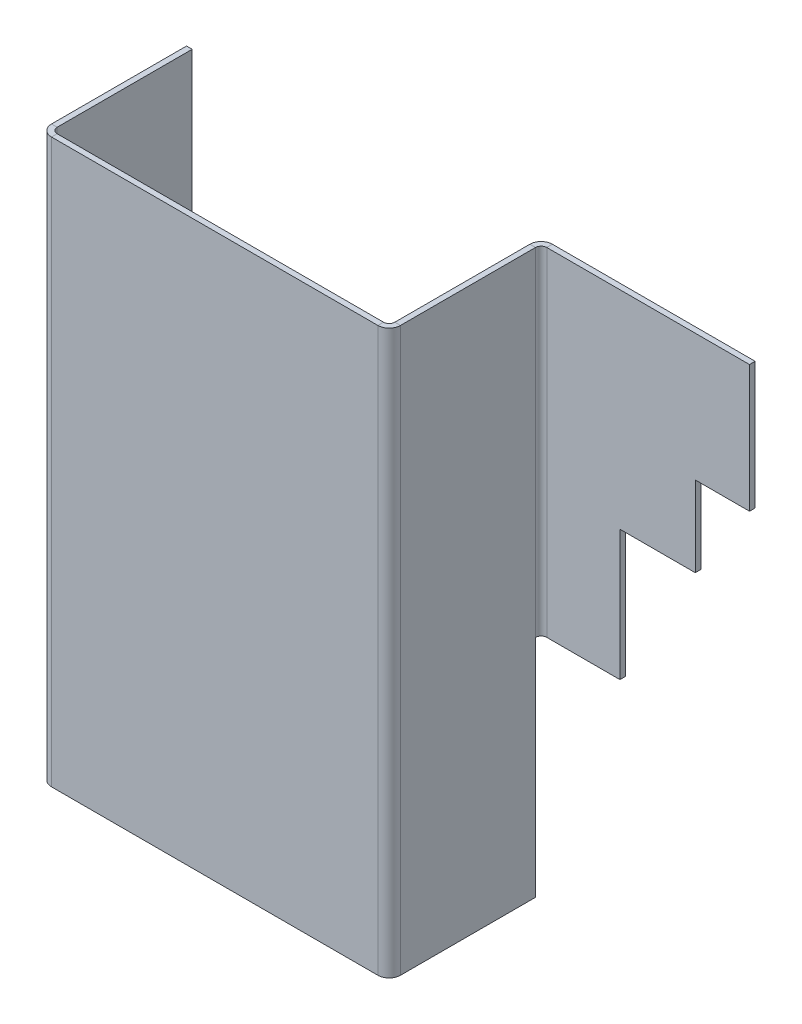
ISO-10303-21;
HEADER;
FILE_DESCRIPTION(('STEP AP214'),'2;1');
FILE_NAME('part.step','',(''),(''),'','','');
FILE_SCHEMA(('AUTOMOTIVE_DESIGN { 1 0 10303 214 1 1 1 1 }'));
ENDSEC;
DATA;
#1=APPLICATION_CONTEXT('core data for automotive mechanical design processes');
#2=APPLICATION_PROTOCOL_DEFINITION('international standard','automotive_design',2000,#1);
#3=PRODUCT_CONTEXT('',#1,'mechanical');
#4=PRODUCT('Part','Part','',(#3));
#5=PRODUCT_RELATED_PRODUCT_CATEGORY('part','',(#4));
#6=PRODUCT_DEFINITION_FORMATION('','',#4);
#7=PRODUCT_DEFINITION_CONTEXT('part definition',#1,'design');
#8=PRODUCT_DEFINITION('design','',#6,#7);
#9=PRODUCT_DEFINITION_SHAPE('','',#8);
#10=(LENGTH_UNIT() NAMED_UNIT(*) SI_UNIT(.MILLI.,.METRE.));
#11=(NAMED_UNIT(*) PLANE_ANGLE_UNIT() SI_UNIT($,.RADIAN.));
#12=(NAMED_UNIT(*) SI_UNIT($,.STERADIAN.) SOLID_ANGLE_UNIT());
#13=UNCERTAINTY_MEASURE_WITH_UNIT(LENGTH_MEASURE(1.E-05),#10,'distance_accuracy_value','');
#14=(GEOMETRIC_REPRESENTATION_CONTEXT(3) GLOBAL_UNCERTAINTY_ASSIGNED_CONTEXT((#13)) GLOBAL_UNIT_ASSIGNED_CONTEXT((#10,
#11,#12)) REPRESENTATION_CONTEXT('',''));
#15=CARTESIAN_POINT('',(0.,0.,0.));
#16=DIRECTION('',(0.,0.,1.));
#17=DIRECTION('',(1.,0.,0.));
#18=AXIS2_PLACEMENT_3D('',#15,#16,#17);
#19=CARTESIAN_POINT('',(60.,100.,-1.));
#20=DIRECTION('',(0.,1.,0.));
#21=DIRECTION('',(0.,0.,1.));
#22=AXIS2_PLACEMENT_3D('',#19,#20,#21);
#23=PLANE('',#22);
#24=DIRECTION('',(1.,0.,0.));
#25=VECTOR('',#24,1.);
#26=CARTESIAN_POINT('',(60.,100.,-1.));
#27=LINE('',#26,#25);
#28=CARTESIAN_POINT('',(60.,100.,-1.));
#29=VERTEX_POINT('',#28);
#30=CARTESIAN_POINT('',(61.,100.,-1.));
#31=VERTEX_POINT('',#30);
#32=EDGE_CURVE('E13',#29,#31,#27,.T.);
#33=ORIENTED_EDGE('',*,*,#32,.F.);
#34=CARTESIAN_POINT('',(59.,100.,-1.));
#35=DIRECTION('',(0.,1.,0.));
#36=DIRECTION('',(0.,0.,1.));
#37=AXIS2_PLACEMENT_3D('',#34,#35,#36);
#38=CIRCLE('',#37,1.);
#39=CARTESIAN_POINT('',(59.,100.,0.));
#40=VERTEX_POINT('',#39);
#41=EDGE_CURVE('E299',#40,#29,#38,.T.);
#42=ORIENTED_EDGE('',*,*,#41,.F.);
#43=DIRECTION('',(0.,0.,-1.));
#44=VECTOR('',#43,1.);
#45=CARTESIAN_POINT('',(59.,100.,1.));
#46=LINE('',#45,#44);
#47=CARTESIAN_POINT('',(59.,100.,1.));
#48=VERTEX_POINT('',#47);
#49=EDGE_CURVE('E66',#48,#40,#46,.T.);
#50=ORIENTED_EDGE('',*,*,#49,.F.);
#51=CARTESIAN_POINT('',(59.,100.,-1.));
#52=DIRECTION('',(0.,1.,0.));
#53=DIRECTION('',(1.,0.,0.));
#54=AXIS2_PLACEMENT_3D('',#51,#52,#53);
#55=CIRCLE('',#54,2.);
#56=EDGE_CURVE('E323',#48,#31,#55,.T.);
#57=ORIENTED_EDGE('',*,*,#56,.T.);
#58=EDGE_LOOP('',(#33,#42,#50,#57));
#59=FACE_BOUND('',#58,.T.);
#60=ADVANCED_FACE('F59',(#59),#23,.T.);
#61=CARTESIAN_POINT('',(59.,100.,1.));
#62=DIRECTION('',(0.,1.,0.));
#63=DIRECTION('',(0.,0.,1.));
#64=AXIS2_PLACEMENT_3D('',#61,#62,#63);
#65=PLANE('',#64);
#66=DIRECTION('',(0.,0.,-1.));
#67=VECTOR('',#66,1.);
#68=CARTESIAN_POINT('',(60.,100.,0.));
#69=LINE('',#68,#67);
#70=CARTESIAN_POINT('',(60.,100.,-25.));
#71=VERTEX_POINT('',#70);
#72=EDGE_CURVE('E296',#29,#71,#69,.T.);
#73=ORIENTED_EDGE('',*,*,#72,.F.);
#74=ORIENTED_EDGE('',*,*,#32,.T.);
#75=DIRECTION('',(0.,0.,-1.));
#76=VECTOR('',#75,1.);
#77=CARTESIAN_POINT('',(61.,100.,0.));
#78=LINE('',#77,#76);
#79=CARTESIAN_POINT('',(61.,100.,-25.));
#80=VERTEX_POINT('',#79);
#81=EDGE_CURVE('E290',#31,#80,#78,.T.);
#82=ORIENTED_EDGE('',*,*,#81,.T.);
#83=DIRECTION('',(1.,0.,0.));
#84=VECTOR('',#83,1.);
#85=CARTESIAN_POINT('',(60.,100.,-25.));
#86=LINE('',#85,#84);
#87=EDGE_CURVE('E292',#71,#80,#86,.T.);
#88=ORIENTED_EDGE('',*,*,#87,.F.);
#89=EDGE_LOOP('',(#73,#74,#82,#88));
#90=FACE_BOUND('',#89,.T.);
#91=ADVANCED_FACE('F464',(#90),#65,.T.);
#92=CARTESIAN_POINT('',(59.,0.,0.));
#93=DIRECTION('',(0.,-1.,0.));
#94=DIRECTION('',(0.,0.,-1.));
#95=AXIS2_PLACEMENT_3D('',#92,#93,#94);
#96=PLANE('',#95);
#97=DIRECTION('',(0.,0.,1.));
#98=VECTOR('',#97,1.);
#99=CARTESIAN_POINT('',(59.,0.,0.));
#100=LINE('',#99,#98);
#101=CARTESIAN_POINT('',(59.,0.,0.));
#102=VERTEX_POINT('',#101);
#103=CARTESIAN_POINT('',(59.,0.,1.));
#104=VERTEX_POINT('',#103);
#105=EDGE_CURVE('E405',#102,#104,#100,.T.);
#106=ORIENTED_EDGE('',*,*,#105,.F.);
#107=CARTESIAN_POINT('',(59.,0.,-1.));
#108=DIRECTION('',(0.,1.,0.));
#109=DIRECTION('',(0.,0.,1.));
#110=AXIS2_PLACEMENT_3D('',#107,#108,#109);
#111=CIRCLE('',#110,1.);
#112=CARTESIAN_POINT('',(60.,0.,-1.));
#113=VERTEX_POINT('',#112);
#114=EDGE_CURVE('E335',#102,#113,#111,.T.);
#115=ORIENTED_EDGE('',*,*,#114,.T.);
#116=DIRECTION('',(-1.,0.,0.));
#117=VECTOR('',#116,1.);
#118=CARTESIAN_POINT('',(61.,0.,-1.));
#119=LINE('',#118,#117);
#120=CARTESIAN_POINT('',(61.,0.,-1.));
#121=VERTEX_POINT('',#120);
#122=EDGE_CURVE('E403',#121,#113,#119,.T.);
#123=ORIENTED_EDGE('',*,*,#122,.F.);
#124=CARTESIAN_POINT('',(59.,0.,-1.));
#125=DIRECTION('',(0.,1.,0.));
#126=DIRECTION('',(1.,0.,0.));
#127=AXIS2_PLACEMENT_3D('',#124,#125,#126);
#128=CIRCLE('',#127,2.);
#129=EDGE_CURVE('E293',#104,#121,#128,.T.);
#130=ORIENTED_EDGE('',*,*,#129,.F.);
#131=EDGE_LOOP('',(#106,#115,#123,#130));
#132=FACE_BOUND('',#131,.T.);
#133=ADVANCED_FACE('F512',(#132),#96,.T.);
#134=CARTESIAN_POINT('',(61.,0.,-1.));
#135=DIRECTION('',(0.,-1.,0.));
#136=DIRECTION('',(0.,0.,-1.));
#137=AXIS2_PLACEMENT_3D('',#134,#135,#136);
#138=PLANE('',#137);
#139=DIRECTION('',(1.,0.,0.));
#140=VECTOR('',#139,1.);
#141=CARTESIAN_POINT('',(0.,0.,0.));
#142=LINE('',#141,#140);
#143=CARTESIAN_POINT('',(0.999999999999999,0.,0.));
#144=VERTEX_POINT('',#143);
#145=EDGE_CURVE('E338',#144,#102,#142,.T.);
#146=ORIENTED_EDGE('',*,*,#145,.T.);
#147=ORIENTED_EDGE('',*,*,#105,.T.);
#148=DIRECTION('',(1.,0.,0.));
#149=VECTOR('',#148,1.);
#150=CARTESIAN_POINT('',(0.,0.,1.));
#151=LINE('',#150,#149);
#152=CARTESIAN_POINT('',(0.999999999999999,0.,1.));
#153=VERTEX_POINT('',#152);
#154=EDGE_CURVE('E356',#153,#104,#151,.T.);
#155=ORIENTED_EDGE('',*,*,#154,.F.);
#156=DIRECTION('',(0.,0.,-1.));
#157=VECTOR('',#156,1.);
#158=CARTESIAN_POINT('',(0.999999999999999,0.,1.));
#159=LINE('',#158,#157);
#160=EDGE_CURVE('E395',#153,#144,#159,.T.);
#161=ORIENTED_EDGE('',*,*,#160,.T.);
#162=EDGE_LOOP('',(#146,#147,#155,#161));
#163=FACE_BOUND('',#162,.T.);
#164=ADVANCED_FACE('F517',(#163),#138,.T.);
#165=CARTESIAN_POINT('',(0.999999999999999,100.,0.));
#166=DIRECTION('',(0.,1.,0.));
#167=DIRECTION('',(0.,0.,1.));
#168=AXIS2_PLACEMENT_3D('',#165,#166,#167);
#169=PLANE('',#168);
#170=DIRECTION('',(0.,0.,1.));
#171=VECTOR('',#170,1.);
#172=CARTESIAN_POINT('',(0.999999999999999,100.,0.));
#173=LINE('',#172,#171);
#174=CARTESIAN_POINT('',(0.999999999999999,100.,0.));
#175=VERTEX_POINT('',#174);
#176=CARTESIAN_POINT('',(0.999999999999999,100.,1.));
#177=VERTEX_POINT('',#176);
#178=EDGE_CURVE('E401',#175,#177,#173,.T.);
#179=ORIENTED_EDGE('',*,*,#178,.F.);
#180=CARTESIAN_POINT('',(1.,100.,-1.));
#181=DIRECTION('',(0.,1.,0.));
#182=DIRECTION('',(0.,0.,1.));
#183=AXIS2_PLACEMENT_3D('',#180,#181,#182);
#184=CIRCLE('',#183,1.);
#185=CARTESIAN_POINT('',(0.,100.,-1.));
#186=VERTEX_POINT('',#185);
#187=EDGE_CURVE('E305',#186,#175,#184,.T.);
#188=ORIENTED_EDGE('',*,*,#187,.F.);
#189=DIRECTION('',(1.,0.,0.));
#190=VECTOR('',#189,1.);
#191=CARTESIAN_POINT('',(-1.,100.,-1.));
#192=LINE('',#191,#190);
#193=CARTESIAN_POINT('',(-1.,100.,-1.));
#194=VERTEX_POINT('',#193);
#195=EDGE_CURVE('E399',#194,#186,#192,.T.);
#196=ORIENTED_EDGE('',*,*,#195,.F.);
#197=CARTESIAN_POINT('',(1.,100.,-1.));
#198=DIRECTION('',(0.,1.,0.));
#199=DIRECTION('',(1.,0.,0.));
#200=AXIS2_PLACEMENT_3D('',#197,#198,#199);
#201=CIRCLE('',#200,2.);
#202=EDGE_CURVE('E317',#194,#177,#201,.T.);
#203=ORIENTED_EDGE('',*,*,#202,.T.);
#204=EDGE_LOOP('',(#179,#188,#196,#203));
#205=FACE_BOUND('',#204,.T.);
#206=ADVANCED_FACE('F428',(#205),#169,.T.);
#207=CARTESIAN_POINT('',(-1.,100.,-1.));
#208=DIRECTION('',(0.,1.,0.));
#209=DIRECTION('',(0.,0.,1.));
#210=AXIS2_PLACEMENT_3D('',#207,#208,#209);
#211=PLANE('',#210);
#212=DIRECTION('',(1.,0.,0.));
#213=VECTOR('',#212,1.);
#214=CARTESIAN_POINT('',(0.,100.,0.));
#215=LINE('',#214,#213);
#216=EDGE_CURVE('E302',#175,#40,#215,.T.);
#217=ORIENTED_EDGE('',*,*,#216,.F.);
#218=ORIENTED_EDGE('',*,*,#178,.T.);
#219=DIRECTION('',(1.,0.,0.));
#220=VECTOR('',#219,1.);
#221=CARTESIAN_POINT('',(0.,100.,1.));
#222=LINE('',#221,#220);
#223=EDGE_CURVE('E320',#177,#48,#222,.T.);
#224=ORIENTED_EDGE('',*,*,#223,.T.);
#225=ORIENTED_EDGE('',*,*,#49,.T.);
#226=EDGE_LOOP('',(#217,#218,#224,#225));
#227=FACE_BOUND('',#226,.T.);
#228=ADVANCED_FACE('F409',(#227),#211,.T.);
#229=CARTESIAN_POINT('',(0.,0.,-1.));
#230=DIRECTION('',(0.,-1.,0.));
#231=DIRECTION('',(0.,0.,-1.));
#232=AXIS2_PLACEMENT_3D('',#229,#230,#231);
#233=PLANE('',#232);
#234=DIRECTION('',(-1.,0.,0.));
#235=VECTOR('',#234,1.);
#236=CARTESIAN_POINT('',(0.,0.,-1.));
#237=LINE('',#236,#235);
#238=CARTESIAN_POINT('',(0.,0.,-1.));
#239=VERTEX_POINT('',#238);
#240=CARTESIAN_POINT('',(-1.,0.,-1.));
#241=VERTEX_POINT('',#240);
#242=EDGE_CURVE('E397',#239,#241,#237,.T.);
#243=ORIENTED_EDGE('',*,*,#242,.F.);
#244=CARTESIAN_POINT('',(1.,0.,-1.));
#245=DIRECTION('',(0.,1.,0.));
#246=DIRECTION('',(0.,0.,1.));
#247=AXIS2_PLACEMENT_3D('',#244,#245,#246);
#248=CIRCLE('',#247,1.);
#249=EDGE_CURVE('E341',#239,#144,#248,.T.);
#250=ORIENTED_EDGE('',*,*,#249,.T.);
#251=ORIENTED_EDGE('',*,*,#160,.F.);
#252=CARTESIAN_POINT('',(1.,0.,-1.));
#253=DIRECTION('',(0.,1.,0.));
#254=DIRECTION('',(1.,0.,0.));
#255=AXIS2_PLACEMENT_3D('',#252,#253,#254);
#256=CIRCLE('',#255,2.);
#257=EDGE_CURVE('E353',#241,#153,#256,.T.);
#258=ORIENTED_EDGE('',*,*,#257,.F.);
#259=EDGE_LOOP('',(#243,#250,#251,#258));
#260=FACE_BOUND('',#259,.T.);
#261=ADVANCED_FACE('F528',(#260),#233,.T.);
#262=CARTESIAN_POINT('',(0.999999999999999,0.,1.));
#263=DIRECTION('',(0.,-1.,0.));
#264=DIRECTION('',(0.,0.,-1.));
#265=AXIS2_PLACEMENT_3D('',#262,#263,#264);
#266=PLANE('',#265);
#267=DIRECTION('',(0.,0.,1.));
#268=VECTOR('',#267,1.);
#269=CARTESIAN_POINT('',(0.,0.,0.));
#270=LINE('',#269,#268);
#271=CARTESIAN_POINT('',(0.,0.,-25.));
#272=VERTEX_POINT('',#271);
#273=EDGE_CURVE('E344',#272,#239,#270,.T.);
#274=ORIENTED_EDGE('',*,*,#273,.T.);
#275=ORIENTED_EDGE('',*,*,#242,.T.);
#276=DIRECTION('',(0.,0.,-1.));
#277=VECTOR('',#276,1.);
#278=CARTESIAN_POINT('',(-1.,0.,0.));
#279=LINE('',#278,#277);
#280=CARTESIAN_POINT('',(-1.,0.,-25.));
#281=VERTEX_POINT('',#280);
#282=EDGE_CURVE('E350',#281,#241,#279,.F.);
#283=ORIENTED_EDGE('',*,*,#282,.F.);
#284=DIRECTION('',(1.,0.,0.));
#285=VECTOR('',#284,1.);
#286=CARTESIAN_POINT('',(-1.,0.,-25.));
#287=LINE('',#286,#285);
#288=EDGE_CURVE('E347',#281,#272,#287,.T.);
#289=ORIENTED_EDGE('',*,*,#288,.T.);
#290=EDGE_LOOP('',(#274,#275,#283,#289));
#291=FACE_BOUND('',#290,.T.);
#292=ADVANCED_FACE('F531',(#291),#266,.T.);
#293=CARTESIAN_POINT('',(61.,100.,0.));
#294=DIRECTION('',(-1.,0.,0.));
#295=DIRECTION('',(0.,0.,1.));
#296=AXIS2_PLACEMENT_3D('',#293,#294,#295);
#297=PLANE('',#296);
#298=DIRECTION('',(0.,0.,-1.));
#299=VECTOR('',#298,1.);
#300=CARTESIAN_POINT('',(61.,0.,0.));
#301=LINE('',#300,#299);
#302=CARTESIAN_POINT('',(61.,0.,-25.));
#303=VERTEX_POINT('',#302);
#304=EDGE_CURVE('E289',#121,#303,#301,.T.);
#305=ORIENTED_EDGE('',*,*,#304,.T.);
#306=DIRECTION('',(0.,-1.,0.));
#307=VECTOR('',#306,1.);
#308=CARTESIAN_POINT('',(61.,100.,-25.));
#309=LINE('',#308,#307);
#310=CARTESIAN_POINT('',(61.,40.,-25.));
#311=VERTEX_POINT('',#310);
#312=EDGE_CURVE('E391',#311,#303,#309,.T.);
#313=ORIENTED_EDGE('',*,*,#312,.F.);
#314=EDGE_CURVE('E392',#80,#311,#309,.T.);
#315=ORIENTED_EDGE('',*,*,#314,.F.);
#316=ORIENTED_EDGE('',*,*,#81,.F.);
#317=DIRECTION('',(0.,-1.,0.));
#318=VECTOR('',#317,1.);
#319=CARTESIAN_POINT('',(61.,100.,-1.));
#320=LINE('',#319,#318);
#321=EDGE_CURVE('E326',#31,#121,#320,.T.);
#322=ORIENTED_EDGE('',*,*,#321,.T.);
#323=EDGE_LOOP('',(#305,#313,#315,#316,#322));
#324=FACE_BOUND('',#323,.T.);
#325=ADVANCED_FACE('F461',(#324),#297,.F.);
#326=CARTESIAN_POINT('',(60.,100.,-25.));
#327=DIRECTION('',(0.,0.,-1.));
#328=DIRECTION('',(-1.,0.,0.));
#329=AXIS2_PLACEMENT_3D('',#326,#327,#328);
#330=PLANE('',#329);
#331=DIRECTION('',(-1.,0.,0.));
#332=VECTOR('',#331,1.);
#333=CARTESIAN_POINT('',(61.,40.,-25.));
#334=LINE('',#333,#332);
#335=CARTESIAN_POINT('',(60.,40.,-25.));
#336=VERTEX_POINT('',#335);
#337=EDGE_CURVE('E81',#311,#336,#334,.T.);
#338=ORIENTED_EDGE('',*,*,#337,.F.);
#339=ORIENTED_EDGE('',*,*,#312,.T.);
#340=DIRECTION('',(1.,0.,0.));
#341=VECTOR('',#340,1.);
#342=CARTESIAN_POINT('',(60.,0.,-25.));
#343=LINE('',#342,#341);
#344=CARTESIAN_POINT('',(60.,0.,-25.));
#345=VERTEX_POINT('',#344);
#346=EDGE_CURVE('E329',#345,#303,#343,.T.);
#347=ORIENTED_EDGE('',*,*,#346,.F.);
#348=DIRECTION('',(0.,-1.,0.));
#349=VECTOR('',#348,1.);
#350=CARTESIAN_POINT('',(60.,100.,-25.));
#351=LINE('',#350,#349);
#352=EDGE_CURVE('E388',#336,#345,#351,.T.);
#353=ORIENTED_EDGE('',*,*,#352,.F.);
#354=EDGE_LOOP('',(#338,#339,#347,#353));
#355=FACE_BOUND('',#354,.T.);
#356=ADVANCED_FACE('F537',(#355),#330,.T.);
#357=CARTESIAN_POINT('',(60.,100.,0.));
#358=DIRECTION('',(-1.,0.,0.));
#359=DIRECTION('',(0.,0.,1.));
#360=AXIS2_PLACEMENT_3D('',#357,#358,#359);
#361=PLANE('',#360);
#362=DIRECTION('',(0.,0.,-1.));
#363=VECTOR('',#362,1.);
#364=CARTESIAN_POINT('',(60.,0.,0.));
#365=LINE('',#364,#363);
#366=EDGE_CURVE('E332',#113,#345,#365,.T.);
#367=ORIENTED_EDGE('',*,*,#366,.F.);
#368=DIRECTION('',(0.,-1.,0.));
#369=VECTOR('',#368,1.);
#370=CARTESIAN_POINT('',(60.,100.,-1.));
#371=LINE('',#370,#369);
#372=EDGE_CURVE('E385',#29,#113,#371,.T.);
#373=ORIENTED_EDGE('',*,*,#372,.F.);
#374=ORIENTED_EDGE('',*,*,#72,.T.);
#375=EDGE_CURVE('E389',#71,#336,#351,.T.);
#376=ORIENTED_EDGE('',*,*,#375,.T.);
#377=ORIENTED_EDGE('',*,*,#352,.T.);
#378=EDGE_LOOP('',(#367,#373,#374,#376,#377));
#379=FACE_BOUND('',#378,.T.);
#380=ADVANCED_FACE('F468',(#379),#361,.T.);
#381=CARTESIAN_POINT('',(59.,100.,-1.));
#382=DIRECTION('',(0.,-1.,0.));
#383=DIRECTION('',(0.,0.,-1.));
#384=AXIS2_PLACEMENT_3D('',#381,#382,#383);
#385=CYLINDRICAL_SURFACE('',#384,1.);
#386=ORIENTED_EDGE('',*,*,#114,.F.);
#387=DIRECTION('',(0.,-1.,0.));
#388=VECTOR('',#387,1.);
#389=CARTESIAN_POINT('',(59.,100.,0.));
#390=LINE('',#389,#388);
#391=EDGE_CURVE('E382',#40,#102,#390,.T.);
#392=ORIENTED_EDGE('',*,*,#391,.F.);
#393=ORIENTED_EDGE('',*,*,#41,.T.);
#394=ORIENTED_EDGE('',*,*,#372,.T.);
#395=EDGE_LOOP('',(#386,#392,#393,#394));
#396=FACE_BOUND('',#395,.T.);
#397=ADVANCED_FACE('F416',(#396),#385,.F.);
#398=CARTESIAN_POINT('',(0.,100.,0.));
#399=DIRECTION('',(0.,0.,-1.));
#400=DIRECTION('',(-1.,0.,0.));
#401=AXIS2_PLACEMENT_3D('',#398,#399,#400);
#402=PLANE('',#401);
#403=ORIENTED_EDGE('',*,*,#145,.F.);
#404=DIRECTION('',(0.,-1.,0.));
#405=VECTOR('',#404,1.);
#406=CARTESIAN_POINT('',(0.999999999999999,100.,0.));
#407=LINE('',#406,#405);
#408=EDGE_CURVE('E379',#175,#144,#407,.T.);
#409=ORIENTED_EDGE('',*,*,#408,.F.);
#410=ORIENTED_EDGE('',*,*,#216,.T.);
#411=ORIENTED_EDGE('',*,*,#391,.T.);
#412=EDGE_LOOP('',(#403,#409,#410,#411));
#413=FACE_BOUND('',#412,.T.);
#414=ADVANCED_FACE('F421',(#413),#402,.T.);
#415=CARTESIAN_POINT('',(1.,100.,-1.));
#416=DIRECTION('',(0.,-1.,0.));
#417=DIRECTION('',(0.,0.,-1.));
#418=AXIS2_PLACEMENT_3D('',#415,#416,#417);
#419=CYLINDRICAL_SURFACE('',#418,1.);
#420=ORIENTED_EDGE('',*,*,#249,.F.);
#421=DIRECTION('',(0.,-1.,0.));
#422=VECTOR('',#421,1.);
#423=CARTESIAN_POINT('',(0.,100.,-1.));
#424=LINE('',#423,#422);
#425=EDGE_CURVE('E376',#186,#239,#424,.T.);
#426=ORIENTED_EDGE('',*,*,#425,.F.);
#427=ORIENTED_EDGE('',*,*,#187,.T.);
#428=ORIENTED_EDGE('',*,*,#408,.T.);
#429=EDGE_LOOP('',(#420,#426,#427,#428));
#430=FACE_BOUND('',#429,.T.);
#431=ADVANCED_FACE('F424',(#430),#419,.F.);
#432=CARTESIAN_POINT('',(0.,100.,0.));
#433=DIRECTION('',(1.,0.,0.));
#434=DIRECTION('',(0.,0.,-1.));
#435=AXIS2_PLACEMENT_3D('',#432,#433,#434);
#436=PLANE('',#435);
#437=ORIENTED_EDGE('',*,*,#273,.F.);
#438=DIRECTION('',(0.,-1.,0.));
#439=VECTOR('',#438,1.);
#440=CARTESIAN_POINT('',(0.,100.,-25.));
#441=LINE('',#440,#439);
#442=CARTESIAN_POINT('',(0.,100.,-25.));
#443=VERTEX_POINT('',#442);
#444=EDGE_CURVE('E374',#443,#272,#441,.T.);
#445=ORIENTED_EDGE('',*,*,#444,.F.);
#446=DIRECTION('',(0.,0.,1.));
#447=VECTOR('',#446,1.);
#448=CARTESIAN_POINT('',(0.,100.,0.));
#449=LINE('',#448,#447);
#450=EDGE_CURVE('E308',#443,#186,#449,.T.);
#451=ORIENTED_EDGE('',*,*,#450,.T.);
#452=ORIENTED_EDGE('',*,*,#425,.T.);
#453=EDGE_LOOP('',(#437,#445,#451,#452));
#454=FACE_BOUND('',#453,.T.);
#455=ADVANCED_FACE('F432',(#454),#436,.T.);
#456=CARTESIAN_POINT('',(-1.,100.,-25.));
#457=DIRECTION('',(0.,0.,-1.));
#458=DIRECTION('',(-1.,0.,0.));
#459=AXIS2_PLACEMENT_3D('',#456,#457,#458);
#460=PLANE('',#459);
#461=ORIENTED_EDGE('',*,*,#288,.F.);
#462=DIRECTION('',(0.,-1.,0.));
#463=VECTOR('',#462,1.);
#464=CARTESIAN_POINT('',(-1.,100.,-25.));
#465=LINE('',#464,#463);
#466=CARTESIAN_POINT('',(-1.,100.,-25.));
#467=VERTEX_POINT('',#466);
#468=EDGE_CURVE('E372',#467,#281,#465,.T.);
#469=ORIENTED_EDGE('',*,*,#468,.F.);
#470=DIRECTION('',(1.,0.,0.));
#471=VECTOR('',#470,1.);
#472=CARTESIAN_POINT('',(-1.,100.,-25.));
#473=LINE('',#472,#471);
#474=EDGE_CURVE('E311',#467,#443,#473,.T.);
#475=ORIENTED_EDGE('',*,*,#474,.T.);
#476=ORIENTED_EDGE('',*,*,#444,.T.);
#477=EDGE_LOOP('',(#461,#469,#475,#476));
#478=FACE_BOUND('',#477,.T.);
#479=ADVANCED_FACE('F438',(#478),#460,.T.);
#480=CARTESIAN_POINT('',(-1.,100.,0.));
#481=DIRECTION('',(1.,0.,0.));
#482=DIRECTION('',(0.,0.,-1.));
#483=AXIS2_PLACEMENT_3D('',#480,#481,#482);
#484=PLANE('',#483);
#485=ORIENTED_EDGE('',*,*,#282,.T.);
#486=DIRECTION('',(0.,-1.,0.));
#487=VECTOR('',#486,1.);
#488=CARTESIAN_POINT('',(-1.,100.,-1.));
#489=LINE('',#488,#487);
#490=EDGE_CURVE('E369',#194,#241,#489,.T.);
#491=ORIENTED_EDGE('',*,*,#490,.F.);
#492=DIRECTION('',(0.,0.,-1.));
#493=VECTOR('',#492,1.);
#494=CARTESIAN_POINT('',(-1.,100.,0.));
#495=LINE('',#494,#493);
#496=EDGE_CURVE('E314',#467,#194,#495,.F.);
#497=ORIENTED_EDGE('',*,*,#496,.F.);
#498=ORIENTED_EDGE('',*,*,#468,.T.);
#499=EDGE_LOOP('',(#485,#491,#497,#498));
#500=FACE_BOUND('',#499,.T.);
#501=ADVANCED_FACE('F443',(#500),#484,.F.);
#502=CARTESIAN_POINT('',(1.,100.,-1.));
#503=DIRECTION('',(0.,-1.,0.));
#504=DIRECTION('',(0.,0.,-1.));
#505=AXIS2_PLACEMENT_3D('',#502,#503,#504);
#506=CYLINDRICAL_SURFACE('',#505,2.);
#507=ORIENTED_EDGE('',*,*,#257,.T.);
#508=DIRECTION('',(0.,-1.,0.));
#509=VECTOR('',#508,1.);
#510=CARTESIAN_POINT('',(0.999999999999999,100.,1.));
#511=LINE('',#510,#509);
#512=EDGE_CURVE('E366',#177,#153,#511,.T.);
#513=ORIENTED_EDGE('',*,*,#512,.F.);
#514=ORIENTED_EDGE('',*,*,#202,.F.);
#515=ORIENTED_EDGE('',*,*,#490,.T.);
#516=EDGE_LOOP('',(#507,#513,#514,#515));
#517=FACE_BOUND('',#516,.T.);
#518=ADVANCED_FACE('F448',(#517),#506,.T.);
#519=CARTESIAN_POINT('',(0.,100.,1.));
#520=DIRECTION('',(0.,0.,-1.));
#521=DIRECTION('',(-1.,0.,0.));
#522=AXIS2_PLACEMENT_3D('',#519,#520,#521);
#523=PLANE('',#522);
#524=ORIENTED_EDGE('',*,*,#154,.T.);
#525=DIRECTION('',(0.,-1.,0.));
#526=VECTOR('',#525,1.);
#527=CARTESIAN_POINT('',(59.,100.,1.));
#528=LINE('',#527,#526);
#529=EDGE_CURVE('E363',#48,#104,#528,.T.);
#530=ORIENTED_EDGE('',*,*,#529,.F.);
#531=ORIENTED_EDGE('',*,*,#223,.F.);
#532=ORIENTED_EDGE('',*,*,#512,.T.);
#533=EDGE_LOOP('',(#524,#530,#531,#532));
#534=FACE_BOUND('',#533,.T.);
#535=ADVANCED_FACE('F451',(#534),#523,.F.);
#536=CARTESIAN_POINT('',(59.,100.,-1.));
#537=DIRECTION('',(0.,-1.,0.));
#538=DIRECTION('',(0.,0.,-1.));
#539=AXIS2_PLACEMENT_3D('',#536,#537,#538);
#540=CYLINDRICAL_SURFACE('',#539,2.);
#541=ORIENTED_EDGE('',*,*,#129,.T.);
#542=ORIENTED_EDGE('',*,*,#321,.F.);
#543=ORIENTED_EDGE('',*,*,#56,.F.);
#544=ORIENTED_EDGE('',*,*,#529,.T.);
#545=EDGE_LOOP('',(#541,#542,#543,#544));
#546=FACE_BOUND('',#545,.T.);
#547=ADVANCED_FACE('F456',(#546),#540,.T.);
#548=CARTESIAN_POINT('',(59.,100.,-1.));
#549=DIRECTION('',(0.,1.,0.));
#550=DIRECTION('',(1.,0.,0.));
#551=AXIS2_PLACEMENT_3D('',#548,#549,#550);
#552=PLANE('',#551);
#553=ORIENTED_EDGE('',*,*,#496,.T.);
#554=ORIENTED_EDGE('',*,*,#195,.T.);
#555=ORIENTED_EDGE('',*,*,#450,.F.);
#556=ORIENTED_EDGE('',*,*,#474,.F.);
#557=EDGE_LOOP('',(#553,#554,#555,#556));
#558=FACE_BOUND('',#557,.T.);
#559=ADVANCED_FACE('F435',(#558),#552,.T.);
#560=CARTESIAN_POINT('',(59.,0.,-1.));
#561=DIRECTION('',(0.,1.,0.));
#562=DIRECTION('',(1.,0.,0.));
#563=AXIS2_PLACEMENT_3D('',#560,#561,#562);
#564=PLANE('',#563);
#565=ORIENTED_EDGE('',*,*,#304,.F.);
#566=ORIENTED_EDGE('',*,*,#122,.T.);
#567=ORIENTED_EDGE('',*,*,#366,.T.);
#568=ORIENTED_EDGE('',*,*,#346,.T.);
#569=EDGE_LOOP('',(#565,#566,#567,#568));
#570=FACE_BOUND('',#569,.T.);
#571=ADVANCED_FACE('F560',(#570),#564,.F.);
#572=CARTESIAN_POINT('',(62.,40.,-25.));
#573=DIRECTION('',(0.,-1.,0.));
#574=DIRECTION('',(0.,0.,-1.));
#575=AXIS2_PLACEMENT_3D('',#572,#573,#574);
#576=PLANE('',#575);
#577=DIRECTION('',(0.,0.,-1.));
#578=VECTOR('',#577,1.);
#579=CARTESIAN_POINT('',(62.,40.,-27.));
#580=LINE('',#579,#578);
#581=CARTESIAN_POINT('',(62.,40.,-26.));
#582=VERTEX_POINT('',#581);
#583=CARTESIAN_POINT('',(62.,40.,-27.));
#584=VERTEX_POINT('',#583);
#585=EDGE_CURVE('E245',#582,#584,#580,.T.);
#586=ORIENTED_EDGE('',*,*,#585,.F.);
#587=CARTESIAN_POINT('',(62.,40.,-25.));
#588=DIRECTION('',(0.,1.,0.));
#589=DIRECTION('',(0.,0.,1.));
#590=AXIS2_PLACEMENT_3D('',#587,#588,#589);
#591=CIRCLE('',#590,1.);
#592=EDGE_CURVE('E283',#311,#582,#591,.F.);
#593=ORIENTED_EDGE('',*,*,#592,.F.);
#594=ORIENTED_EDGE('',*,*,#337,.T.);
#595=CARTESIAN_POINT('',(62.,40.,-25.));
#596=DIRECTION('',(0.,1.,0.));
#597=DIRECTION('',(0.,0.,1.));
#598=AXIS2_PLACEMENT_3D('',#595,#596,#597);
#599=CIRCLE('',#598,2.);
#600=EDGE_CURVE('E277',#336,#584,#599,.F.);
#601=ORIENTED_EDGE('',*,*,#600,.T.);
#602=EDGE_LOOP('',(#586,#593,#594,#601));
#603=FACE_BOUND('',#602,.T.);
#604=ADVANCED_FACE('F495',(#603),#576,.T.);
#605=CARTESIAN_POINT('',(62.,100.,-25.));
#606=DIRECTION('',(0.,-1.,0.));
#607=DIRECTION('',(0.,0.,-1.));
#608=AXIS2_PLACEMENT_3D('',#605,#606,#607);
#609=PLANE('',#608);
#610=CARTESIAN_POINT('',(62.,100.,-25.));
#611=DIRECTION('',(0.,1.,0.));
#612=DIRECTION('',(0.,0.,1.));
#613=AXIS2_PLACEMENT_3D('',#610,#611,#612);
#614=CIRCLE('',#613,1.);
#615=CARTESIAN_POINT('',(62.,100.,-26.));
#616=VERTEX_POINT('',#615);
#617=EDGE_CURVE('E253',#616,#80,#614,.T.);
#618=ORIENTED_EDGE('',*,*,#617,.F.);
#619=DIRECTION('',(0.,0.,-1.));
#620=VECTOR('',#619,1.);
#621=CARTESIAN_POINT('',(62.,100.,-26.));
#622=LINE('',#621,#620);
#623=CARTESIAN_POINT('',(62.,100.,-27.));
#624=VERTEX_POINT('',#623);
#625=EDGE_CURVE('E270',#616,#624,#622,.T.);
#626=ORIENTED_EDGE('',*,*,#625,.T.);
#627=CARTESIAN_POINT('',(62.,100.,-25.));
#628=DIRECTION('',(0.,1.,0.));
#629=DIRECTION('',(0.,0.,1.));
#630=AXIS2_PLACEMENT_3D('',#627,#628,#629);
#631=CIRCLE('',#630,2.);
#632=EDGE_CURVE('E280',#624,#71,#631,.T.);
#633=ORIENTED_EDGE('',*,*,#632,.T.);
#634=ORIENTED_EDGE('',*,*,#87,.T.);
#635=EDGE_LOOP('',(#618,#626,#633,#634));
#636=FACE_BOUND('',#635,.T.);
#637=ADVANCED_FACE('F474',(#636),#609,.F.);
#638=CARTESIAN_POINT('',(62.,100.,-25.));
#639=DIRECTION('',(0.,1.,0.));
#640=DIRECTION('',(0.,0.,-1.));
#641=AXIS2_PLACEMENT_3D('',#638,#639,#640);
#642=CYLINDRICAL_SURFACE('',#641,2.);
#643=ORIENTED_EDGE('',*,*,#375,.F.);
#644=ORIENTED_EDGE('',*,*,#632,.F.);
#645=DIRECTION('',(0.,1.,0.));
#646=VECTOR('',#645,1.);
#647=CARTESIAN_POINT('',(62.,0.,-27.));
#648=LINE('',#647,#646);
#649=EDGE_CURVE('E267',#584,#624,#648,.T.);
#650=ORIENTED_EDGE('',*,*,#649,.F.);
#651=ORIENTED_EDGE('',*,*,#600,.F.);
#652=EDGE_LOOP('',(#643,#644,#650,#651));
#653=FACE_BOUND('',#652,.T.);
#654=ADVANCED_FACE('F471',(#653),#642,.T.);
#655=CARTESIAN_POINT('',(62.,100.,-25.));
#656=DIRECTION('',(0.,1.,0.));
#657=DIRECTION('',(0.,0.,-1.));
#658=AXIS2_PLACEMENT_3D('',#655,#656,#657);
#659=CYLINDRICAL_SURFACE('',#658,1.);
#660=ORIENTED_EDGE('',*,*,#314,.T.);
#661=ORIENTED_EDGE('',*,*,#592,.T.);
#662=DIRECTION('',(0.,-1.,0.));
#663=VECTOR('',#662,1.);
#664=CARTESIAN_POINT('',(62.,40.,-26.));
#665=LINE('',#664,#663);
#666=EDGE_CURVE('E273',#582,#616,#665,.F.);
#667=ORIENTED_EDGE('',*,*,#666,.T.);
#668=ORIENTED_EDGE('',*,*,#617,.T.);
#669=EDGE_LOOP('',(#660,#661,#667,#668));
#670=FACE_BOUND('',#669,.T.);
#671=ADVANCED_FACE('F497',(#670),#659,.F.);
#672=CARTESIAN_POINT('',(61.,100.,-27.));
#673=DIRECTION('',(0.,1.,0.));
#674=DIRECTION('',(0.,0.,1.));
#675=AXIS2_PLACEMENT_3D('',#672,#673,#674);
#676=PLANE('',#675);
#677=DIRECTION('',(-1.,0.,0.));
#678=VECTOR('',#677,1.);
#679=CARTESIAN_POINT('',(61.,100.,-27.));
#680=LINE('',#679,#678);
#681=CARTESIAN_POINT('',(98.0257680872151,100.,-27.0000000000001));
#682=VERTEX_POINT('',#681);
#683=EDGE_CURVE('E254',#682,#624,#680,.T.);
#684=ORIENTED_EDGE('',*,*,#683,.T.);
#685=ORIENTED_EDGE('',*,*,#625,.F.);
#686=DIRECTION('',(1.,0.,0.));
#687=VECTOR('',#686,1.);
#688=CARTESIAN_POINT('',(0.,100.,-25.9999999999998));
#689=LINE('',#688,#687);
#690=CARTESIAN_POINT('',(98.0257680872151,100.,-26.0000000000001));
#691=VERTEX_POINT('',#690);
#692=EDGE_CURVE('E261',#691,#616,#689,.F.);
#693=ORIENTED_EDGE('',*,*,#692,.F.);
#694=DIRECTION('',(0.,0.,-1.));
#695=VECTOR('',#694,1.);
#696=CARTESIAN_POINT('',(98.0257680872151,100.,-26.0000000000001));
#697=LINE('',#696,#695);
#698=EDGE_CURVE('E229',#691,#682,#697,.T.);
#699=ORIENTED_EDGE('',*,*,#698,.T.);
#700=EDGE_LOOP('',(#684,#685,#693,#699));
#701=FACE_BOUND('',#700,.T.);
#702=ADVANCED_FACE('F481',(#701),#676,.T.);
#703=CARTESIAN_POINT('',(75.,40.,-27.));
#704=DIRECTION('',(0.,-1.,0.));
#705=DIRECTION('',(0.,0.,-1.));
#706=AXIS2_PLACEMENT_3D('',#703,#704,#705);
#707=PLANE('',#706);
#708=DIRECTION('',(-1.,0.,0.));
#709=VECTOR('',#708,1.);
#710=CARTESIAN_POINT('',(0.,40.,-25.9999999999998));
#711=LINE('',#710,#709);
#712=CARTESIAN_POINT('',(75.,40.,-26.));
#713=VERTEX_POINT('',#712);
#714=EDGE_CURVE('E265',#582,#713,#711,.F.);
#715=ORIENTED_EDGE('',*,*,#714,.F.);
#716=ORIENTED_EDGE('',*,*,#585,.T.);
#717=DIRECTION('',(1.,0.,0.));
#718=VECTOR('',#717,1.);
#719=CARTESIAN_POINT('',(75.,40.,-27.));
#720=LINE('',#719,#718);
#721=CARTESIAN_POINT('',(75.,40.,-27.));
#722=VERTEX_POINT('',#721);
#723=EDGE_CURVE('E259',#584,#722,#720,.T.);
#724=ORIENTED_EDGE('',*,*,#723,.T.);
#725=DIRECTION('',(0.,0.,1.));
#726=VECTOR('',#725,1.);
#727=CARTESIAN_POINT('',(75.,40.,-27.));
#728=LINE('',#727,#726);
#729=EDGE_CURVE('E250',#722,#713,#728,.T.);
#730=ORIENTED_EDGE('',*,*,#729,.T.);
#731=EDGE_LOOP('',(#715,#716,#724,#730));
#732=FACE_BOUND('',#731,.T.);
#733=ADVANCED_FACE('F492',(#732),#707,.T.);
#734=CARTESIAN_POINT('',(0.,0.,-26.9999999999998));
#735=DIRECTION('',(0.,0.,-1.));
#736=DIRECTION('',(-1.,0.,0.));
#737=AXIS2_PLACEMENT_3D('',#734,#735,#736);
#738=PLANE('',#737);
#739=ORIENTED_EDGE('',*,*,#723,.F.);
#740=ORIENTED_EDGE('',*,*,#649,.T.);
#741=ORIENTED_EDGE('',*,*,#683,.F.);
#742=DIRECTION('',(0.,-1.,0.));
#743=VECTOR('',#742,1.);
#744=CARTESIAN_POINT('',(98.0257680872151,100.,-27.0000000000001));
#745=LINE('',#744,#743);
#746=CARTESIAN_POINT('',(98.0257680872151,77.4199601249573,-27.0000000000001));
#747=VERTEX_POINT('',#746);
#748=EDGE_CURVE('E239',#682,#747,#745,.T.);
#749=ORIENTED_EDGE('',*,*,#748,.T.);
#750=DIRECTION('',(-1.,0.,0.));
#751=VECTOR('',#750,1.);
#752=CARTESIAN_POINT('',(98.0257680872151,77.4199601249573,-27.0000000000001));
#753=LINE('',#752,#751);
#754=CARTESIAN_POINT('',(88.3901204944969,77.4199601249573,-27.0000000000001));
#755=VERTEX_POINT('',#754);
#756=EDGE_CURVE('E207',#747,#755,#753,.T.);
#757=ORIENTED_EDGE('',*,*,#756,.T.);
#758=DIRECTION('',(0.,-1.,0.));
#759=VECTOR('',#758,1.);
#760=CARTESIAN_POINT('',(88.3901204944969,77.4199601249573,-27.0000000000001));
#761=LINE('',#760,#759);
#762=CARTESIAN_POINT('',(88.3901204944969,63.1449266542638,-27.0000000000001));
#763=VERTEX_POINT('',#762);
#764=EDGE_CURVE('E233',#755,#763,#761,.T.);
#765=ORIENTED_EDGE('',*,*,#764,.T.);
#766=DIRECTION('',(-1.,0.,0.));
#767=VECTOR('',#766,1.);
#768=CARTESIAN_POINT('',(88.3901204944969,63.1449266542638,-27.0000000000001));
#769=LINE('',#768,#767);
#770=CARTESIAN_POINT('',(75.,63.1449266542638,-27.));
#771=VERTEX_POINT('',#770);
#772=EDGE_CURVE('E230',#763,#771,#769,.T.);
#773=ORIENTED_EDGE('',*,*,#772,.T.);
#774=DIRECTION('',(0.,1.,0.));
#775=VECTOR('',#774,1.);
#776=CARTESIAN_POINT('',(75.,100.,-27.));
#777=LINE('',#776,#775);
#778=EDGE_CURVE('E257',#722,#771,#777,.T.);
#779=ORIENTED_EDGE('',*,*,#778,.F.);
#780=EDGE_LOOP('',(#739,#740,#741,#749,#757,#765,#773,#779));
#781=FACE_BOUND('',#780,.T.);
#782=ADVANCED_FACE('F479',(#781),#738,.T.);
#783=CARTESIAN_POINT('',(0.,0.,-25.9999999999998));
#784=DIRECTION('',(0.,0.,-1.));
#785=DIRECTION('',(-1.,0.,0.));
#786=AXIS2_PLACEMENT_3D('',#783,#784,#785);
#787=PLANE('',#786);
#788=ORIENTED_EDGE('',*,*,#666,.F.);
#789=ORIENTED_EDGE('',*,*,#714,.T.);
#790=DIRECTION('',(0.,-1.,0.));
#791=VECTOR('',#790,1.);
#792=CARTESIAN_POINT('',(75.,0.,-26.));
#793=LINE('',#792,#791);
#794=CARTESIAN_POINT('',(75.,63.1449266542638,-26.));
#795=VERTEX_POINT('',#794);
#796=EDGE_CURVE('E263',#713,#795,#793,.F.);
#797=ORIENTED_EDGE('',*,*,#796,.T.);
#798=DIRECTION('',(-1.,0.,0.));
#799=VECTOR('',#798,1.);
#800=CARTESIAN_POINT('',(88.3901204944969,63.1449266542638,-26.0000000000001));
#801=LINE('',#800,#799);
#802=CARTESIAN_POINT('',(88.3901204944969,63.1449266542638,-26.0000000000001));
#803=VERTEX_POINT('',#802);
#804=EDGE_CURVE('E213',#803,#795,#801,.T.);
#805=ORIENTED_EDGE('',*,*,#804,.F.);
#806=DIRECTION('',(0.,-1.,0.));
#807=VECTOR('',#806,1.);
#808=CARTESIAN_POINT('',(88.3901204944969,77.4199601249573,-26.0000000000001));
#809=LINE('',#808,#807);
#810=CARTESIAN_POINT('',(88.3901204944969,77.4199601249573,-26.0000000000001));
#811=VERTEX_POINT('',#810);
#812=EDGE_CURVE('E224',#811,#803,#809,.T.);
#813=ORIENTED_EDGE('',*,*,#812,.F.);
#814=DIRECTION('',(-1.,0.,0.));
#815=VECTOR('',#814,1.);
#816=CARTESIAN_POINT('',(98.0257680872151,77.4199601249573,-26.0000000000001));
#817=LINE('',#816,#815);
#818=CARTESIAN_POINT('',(98.0257680872151,77.4199601249573,-26.0000000000001));
#819=VERTEX_POINT('',#818);
#820=EDGE_CURVE('E205',#819,#811,#817,.T.);
#821=ORIENTED_EDGE('',*,*,#820,.F.);
#822=DIRECTION('',(0.,-1.,0.));
#823=VECTOR('',#822,1.);
#824=CARTESIAN_POINT('',(98.0257680872151,100.,-26.0000000000001));
#825=LINE('',#824,#823);
#826=EDGE_CURVE('E221',#691,#819,#825,.T.);
#827=ORIENTED_EDGE('',*,*,#826,.F.);
#828=ORIENTED_EDGE('',*,*,#692,.T.);
#829=EDGE_LOOP('',(#788,#789,#797,#805,#813,#821,#827,#828));
#830=FACE_BOUND('',#829,.T.);
#831=ADVANCED_FACE('F219',(#830),#787,.F.);
#832=CARTESIAN_POINT('',(75.,100.,-27.));
#833=DIRECTION('',(1.,0.,0.));
#834=DIRECTION('',(0.,0.,-1.));
#835=AXIS2_PLACEMENT_3D('',#832,#833,#834);
#836=PLANE('',#835);
#837=DIRECTION('',(0.,0.,-1.));
#838=VECTOR('',#837,1.);
#839=CARTESIAN_POINT('',(75.,63.1449266542638,-26.));
#840=LINE('',#839,#838);
#841=EDGE_CURVE('E73',#795,#771,#840,.T.);
#842=ORIENTED_EDGE('',*,*,#841,.F.);
#843=ORIENTED_EDGE('',*,*,#796,.F.);
#844=ORIENTED_EDGE('',*,*,#729,.F.);
#845=ORIENTED_EDGE('',*,*,#778,.T.);
#846=EDGE_LOOP('',(#842,#843,#844,#845));
#847=FACE_BOUND('',#846,.T.);
#848=ADVANCED_FACE('F490',(#847),#836,.T.);
#849=CARTESIAN_POINT('',(98.0257680872151,100.,-26.0000000000001));
#850=DIRECTION('',(1.,0.,0.));
#851=DIRECTION('',(0.,0.,-1.));
#852=AXIS2_PLACEMENT_3D('',#849,#850,#851);
#853=PLANE('',#852);
#854=ORIENTED_EDGE('',*,*,#748,.F.);
#855=ORIENTED_EDGE('',*,*,#698,.F.);
#856=ORIENTED_EDGE('',*,*,#826,.T.);
#857=DIRECTION('',(0.,0.,-1.));
#858=VECTOR('',#857,1.);
#859=CARTESIAN_POINT('',(98.0257680872151,77.4199601249573,-26.0000000000001));
#860=LINE('',#859,#858);
#861=EDGE_CURVE('E202',#819,#747,#860,.T.);
#862=ORIENTED_EDGE('',*,*,#861,.T.);
#863=EDGE_LOOP('',(#854,#855,#856,#862));
#864=FACE_BOUND('',#863,.T.);
#865=ADVANCED_FACE('F227',(#864),#853,.T.);
#866=CARTESIAN_POINT('',(88.3901204944969,63.1449266542638,-26.0000000000001));
#867=DIRECTION('',(0.,-1.,0.));
#868=DIRECTION('',(0.,0.,-1.));
#869=AXIS2_PLACEMENT_3D('',#866,#867,#868);
#870=PLANE('',#869);
#871=ORIENTED_EDGE('',*,*,#772,.F.);
#872=DIRECTION('',(0.,0.,-1.));
#873=VECTOR('',#872,1.);
#874=CARTESIAN_POINT('',(88.3901204944969,63.1449266542638,-26.0000000000001));
#875=LINE('',#874,#873);
#876=EDGE_CURVE('E247',#803,#763,#875,.T.);
#877=ORIENTED_EDGE('',*,*,#876,.F.);
#878=ORIENTED_EDGE('',*,*,#804,.T.);
#879=ORIENTED_EDGE('',*,*,#841,.T.);
#880=EDGE_LOOP('',(#871,#877,#878,#879));
#881=FACE_BOUND('',#880,.T.);
#882=ADVANCED_FACE('F487',(#881),#870,.T.);
#883=CARTESIAN_POINT('',(88.3901204944969,77.4199601249573,-26.0000000000001));
#884=DIRECTION('',(1.,0.,0.));
#885=DIRECTION('',(0.,0.,-1.));
#886=AXIS2_PLACEMENT_3D('',#883,#884,#885);
#887=PLANE('',#886);
#888=ORIENTED_EDGE('',*,*,#764,.F.);
#889=DIRECTION('',(0.,0.,-1.));
#890=VECTOR('',#889,1.);
#891=CARTESIAN_POINT('',(88.3901204944969,77.4199601249573,-26.0000000000001));
#892=LINE('',#891,#890);
#893=EDGE_CURVE('E212',#811,#755,#892,.T.);
#894=ORIENTED_EDGE('',*,*,#893,.F.);
#895=ORIENTED_EDGE('',*,*,#812,.T.);
#896=ORIENTED_EDGE('',*,*,#876,.T.);
#897=EDGE_LOOP('',(#888,#894,#895,#896));
#898=FACE_BOUND('',#897,.T.);
#899=ADVANCED_FACE('F485',(#898),#887,.T.);
#900=CARTESIAN_POINT('',(98.0257680872151,77.4199601249573,-26.0000000000001));
#901=DIRECTION('',(0.,-1.,0.));
#902=DIRECTION('',(0.,0.,-1.));
#903=AXIS2_PLACEMENT_3D('',#900,#901,#902);
#904=PLANE('',#903);
#905=ORIENTED_EDGE('',*,*,#756,.F.);
#906=ORIENTED_EDGE('',*,*,#861,.F.);
#907=ORIENTED_EDGE('',*,*,#820,.T.);
#908=ORIENTED_EDGE('',*,*,#893,.T.);
#909=EDGE_LOOP('',(#905,#906,#907,#908));
#910=FACE_BOUND('',#909,.T.);
#911=ADVANCED_FACE('F204',(#910),#904,.T.);
#912=CLOSED_SHELL('',(#60,#91,#133,#164,#206,#228,#261,#292,#325,#356,#380,#397,#414,#431,#455,
#479,#501,#518,#535,#547,#559,#571,#604,#637,#654,#671,#702,#733,#782,#831,#848,#865,#882,#899,#911));
#913=MANIFOLD_SOLID_BREP('B2',#912);
#914=ADVANCED_BREP_SHAPE_REPRESENTATION('',(#18,#913),#14);
#915=SHAPE_DEFINITION_REPRESENTATION(#9,#914);
ENDSEC;
END-ISO-10303-21;
